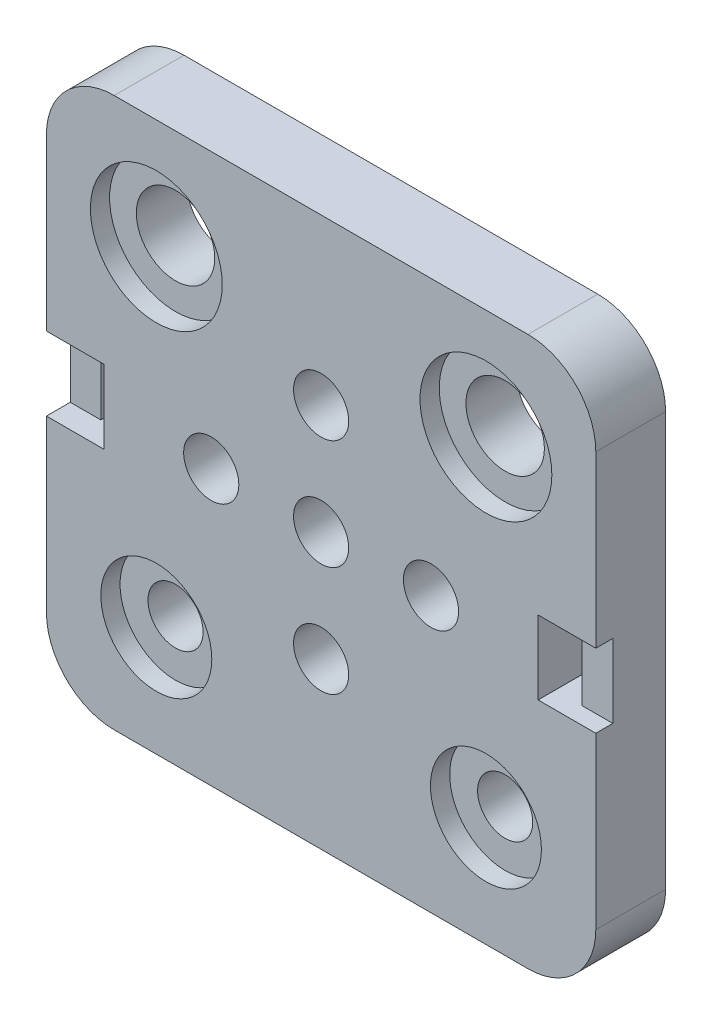
ISO-10303-21;
HEADER;
FILE_DESCRIPTION(('STEP AP214'),'2;1');
FILE_NAME('part.step','',(''),(''),'','','');
FILE_SCHEMA(('AUTOMOTIVE_DESIGN { 1 0 10303 214 1 1 1 1 }'));
ENDSEC;
DATA;
#1=APPLICATION_CONTEXT('core data for automotive mechanical design processes');
#2=APPLICATION_PROTOCOL_DEFINITION('international standard','automotive_design',2000,#1);
#3=PRODUCT_CONTEXT('',#1,'mechanical');
#4=PRODUCT('Part','Part','',(#3));
#5=PRODUCT_RELATED_PRODUCT_CATEGORY('part','',(#4));
#6=PRODUCT_DEFINITION_FORMATION('','',#4);
#7=PRODUCT_DEFINITION_CONTEXT('part definition',#1,'design');
#8=PRODUCT_DEFINITION('design','',#6,#7);
#9=PRODUCT_DEFINITION_SHAPE('','',#8);
#10=(LENGTH_UNIT() NAMED_UNIT(*) SI_UNIT(.MILLI.,.METRE.));
#11=(NAMED_UNIT(*) PLANE_ANGLE_UNIT() SI_UNIT($,.RADIAN.));
#12=(NAMED_UNIT(*) SI_UNIT($,.STERADIAN.) SOLID_ANGLE_UNIT());
#13=UNCERTAINTY_MEASURE_WITH_UNIT(LENGTH_MEASURE(1.E-05),#10,'distance_accuracy_value','');
#14=(GEOMETRIC_REPRESENTATION_CONTEXT(3) GLOBAL_UNCERTAINTY_ASSIGNED_CONTEXT((#13)) GLOBAL_UNIT_ASSIGNED_CONTEXT((#10,
#11,#12)) REPRESENTATION_CONTEXT('',''));
#15=CARTESIAN_POINT('',(0.,0.,0.));
#16=DIRECTION('',(0.,0.,1.));
#17=DIRECTION('',(1.,0.,0.));
#18=AXIS2_PLACEMENT_3D('',#15,#16,#17);
#19=CARTESIAN_POINT('',(25.,3.35,-0.65));
#20=DIRECTION('',(0.,1.,0.));
#21=DIRECTION('',(0.,0.,1.));
#22=AXIS2_PLACEMENT_3D('',#19,#20,#21);
#23=PLANE('',#22);
#24=DIRECTION('',(-1.,0.,0.));
#25=VECTOR('',#24,1.);
#26=CARTESIAN_POINT('',(25.,3.35,4.8));
#27=LINE('',#26,#25);
#28=CARTESIAN_POINT('',(25.,3.35,4.8));
#29=VERTEX_POINT('',#28);
#30=CARTESIAN_POINT('',(22.21,3.35,4.8));
#31=VERTEX_POINT('',#30);
#32=EDGE_CURVE('E766',#29,#31,#27,.T.);
#33=ORIENTED_EDGE('',*,*,#32,.F.);
#34=DIRECTION('',(0.,0.,-1.));
#35=VECTOR('',#34,1.);
#36=CARTESIAN_POINT('',(25.,3.35,6.35));
#37=LINE('',#36,#35);
#38=CARTESIAN_POINT('',(25.,3.35,6.35));
#39=VERTEX_POINT('',#38);
#40=EDGE_CURVE('E334',#39,#29,#37,.T.);
#41=ORIENTED_EDGE('',*,*,#40,.F.);
#42=DIRECTION('',(-1.,0.,0.));
#43=VECTOR('',#42,1.);
#44=CARTESIAN_POINT('',(25.,3.35,6.35));
#45=LINE('',#44,#43);
#46=CARTESIAN_POINT('',(19.75,3.35,6.35));
#47=VERTEX_POINT('',#46);
#48=EDGE_CURVE('E774',#39,#47,#45,.T.);
#49=ORIENTED_EDGE('',*,*,#48,.T.);
#50=DIRECTION('',(0.,0.,1.));
#51=VECTOR('',#50,1.);
#52=CARTESIAN_POINT('',(19.75,3.35,-0.65));
#53=LINE('',#52,#51);
#54=CARTESIAN_POINT('',(19.75,3.35,0.));
#55=VERTEX_POINT('',#54);
#56=EDGE_CURVE('E202',#55,#47,#53,.T.);
#57=ORIENTED_EDGE('',*,*,#56,.F.);
#58=DIRECTION('',(-1.,0.,0.));
#59=VECTOR('',#58,1.);
#60=CARTESIAN_POINT('',(0.,3.35,0.));
#61=LINE('',#60,#59);
#62=CARTESIAN_POINT('',(22.21,3.35,0.));
#63=VERTEX_POINT('',#62);
#64=EDGE_CURVE('E197',#63,#55,#61,.T.);
#65=ORIENTED_EDGE('',*,*,#64,.F.);
#66=DIRECTION('',(0.,0.,-1.));
#67=VECTOR('',#66,1.);
#68=CARTESIAN_POINT('',(22.21,3.35,0.));
#69=LINE('',#68,#67);
#70=EDGE_CURVE('E178',#31,#63,#69,.T.);
#71=ORIENTED_EDGE('',*,*,#70,.F.);
#72=EDGE_LOOP('',(#33,#41,#49,#57,#65,#71));
#73=FACE_BOUND('',#72,.T.);
#74=ADVANCED_FACE('F34',(#73),#23,.F.);
#75=CARTESIAN_POINT('',(25.,-3.35,-0.65));
#76=DIRECTION('',(0.,-1.,0.));
#77=DIRECTION('',(1.,0.,0.));
#78=AXIS2_PLACEMENT_3D('',#75,#76,#77);
#79=PLANE('',#78);
#80=DIRECTION('',(-1.,0.,0.));
#81=VECTOR('',#80,1.);
#82=CARTESIAN_POINT('',(25.,-3.35000000000002,4.8));
#83=LINE('',#82,#81);
#84=CARTESIAN_POINT('',(25.,-3.35000000000002,4.8));
#85=VERTEX_POINT('',#84);
#86=CARTESIAN_POINT('',(22.21,-3.35000000000002,4.8));
#87=VERTEX_POINT('',#86);
#88=EDGE_CURVE('E182',#85,#87,#83,.T.);
#89=ORIENTED_EDGE('',*,*,#88,.T.);
#90=DIRECTION('',(0.,0.,-1.));
#91=VECTOR('',#90,1.);
#92=CARTESIAN_POINT('',(22.21,-3.35000000000002,0.));
#93=LINE('',#92,#91);
#94=CARTESIAN_POINT('',(22.21,-3.35000000000002,0.));
#95=VERTEX_POINT('',#94);
#96=EDGE_CURVE('E175',#87,#95,#93,.T.);
#97=ORIENTED_EDGE('',*,*,#96,.T.);
#98=DIRECTION('',(1.,0.,0.));
#99=VECTOR('',#98,1.);
#100=CARTESIAN_POINT('',(0.,-3.35000000000001,0.));
#101=LINE('',#100,#99);
#102=CARTESIAN_POINT('',(19.75,-3.35,0.));
#103=VERTEX_POINT('',#102);
#104=EDGE_CURVE('E187',#103,#95,#101,.T.);
#105=ORIENTED_EDGE('',*,*,#104,.F.);
#106=DIRECTION('',(0.,0.,1.));
#107=VECTOR('',#106,1.);
#108=CARTESIAN_POINT('',(19.75,-3.35,-0.65));
#109=LINE('',#108,#107);
#110=CARTESIAN_POINT('',(19.75,-3.35,6.35));
#111=VERTEX_POINT('',#110);
#112=EDGE_CURVE('E198',#103,#111,#109,.T.);
#113=ORIENTED_EDGE('',*,*,#112,.T.);
#114=DIRECTION('',(1.,0.,0.));
#115=VECTOR('',#114,1.);
#116=CARTESIAN_POINT('',(25.,-3.35,6.35));
#117=LINE('',#116,#115);
#118=CARTESIAN_POINT('',(25.,-3.35,6.35));
#119=VERTEX_POINT('',#118);
#120=EDGE_CURVE('E769',#111,#119,#117,.T.);
#121=ORIENTED_EDGE('',*,*,#120,.T.);
#122=DIRECTION('',(0.,0.,1.));
#123=VECTOR('',#122,1.);
#124=CARTESIAN_POINT('',(25.,-3.35,6.35));
#125=LINE('',#124,#123);
#126=EDGE_CURVE('E331',#85,#119,#125,.T.);
#127=ORIENTED_EDGE('',*,*,#126,.F.);
#128=EDGE_LOOP('',(#89,#97,#105,#113,#121,#127));
#129=FACE_BOUND('',#128,.T.);
#130=ADVANCED_FACE('F186',(#129),#79,.F.);
#131=CARTESIAN_POINT('',(-25.,3.35,-0.65));
#132=DIRECTION('',(0.,1.,0.));
#133=DIRECTION('',(0.,0.,1.));
#134=AXIS2_PLACEMENT_3D('',#131,#132,#133);
#135=PLANE('',#134);
#136=DIRECTION('',(0.,0.,1.));
#137=VECTOR('',#136,1.);
#138=CARTESIAN_POINT('',(-22.215,3.35,0.));
#139=LINE('',#138,#137);
#140=CARTESIAN_POINT('',(-22.215,3.35,0.));
#141=VERTEX_POINT('',#140);
#142=CARTESIAN_POINT('',(-22.215,3.35,4.18));
#143=VERTEX_POINT('',#142);
#144=EDGE_CURVE('E787',#141,#143,#139,.T.);
#145=ORIENTED_EDGE('',*,*,#144,.F.);
#146=DIRECTION('',(-1.,0.,0.));
#147=VECTOR('',#146,1.);
#148=CARTESIAN_POINT('',(0.,3.35,0.));
#149=LINE('',#148,#147);
#150=CARTESIAN_POINT('',(-19.75,3.35,0.));
#151=VERTEX_POINT('',#150);
#152=EDGE_CURVE('E220',#151,#141,#149,.T.);
#153=ORIENTED_EDGE('',*,*,#152,.F.);
#154=DIRECTION('',(0.,0.,1.));
#155=VECTOR('',#154,1.);
#156=CARTESIAN_POINT('',(-19.75,3.35,-0.65));
#157=LINE('',#156,#155);
#158=CARTESIAN_POINT('',(-19.75,3.35,6.35));
#159=VERTEX_POINT('',#158);
#160=EDGE_CURVE('E215',#151,#159,#157,.T.);
#161=ORIENTED_EDGE('',*,*,#160,.T.);
#162=DIRECTION('',(-1.,0.,0.));
#163=VECTOR('',#162,1.);
#164=CARTESIAN_POINT('',(-25.,3.35,6.35));
#165=LINE('',#164,#163);
#166=CARTESIAN_POINT('',(-25.,3.35,6.35));
#167=VERTEX_POINT('',#166);
#168=EDGE_CURVE('E211',#159,#167,#165,.T.);
#169=ORIENTED_EDGE('',*,*,#168,.T.);
#170=DIRECTION('',(0.,0.,1.));
#171=VECTOR('',#170,1.);
#172=CARTESIAN_POINT('',(-25.,3.35,6.35));
#173=LINE('',#172,#171);
#174=CARTESIAN_POINT('',(-25.,3.35,4.18));
#175=VERTEX_POINT('',#174);
#176=EDGE_CURVE('E325',#175,#167,#173,.T.);
#177=ORIENTED_EDGE('',*,*,#176,.F.);
#178=DIRECTION('',(-1.,0.,0.));
#179=VECTOR('',#178,1.);
#180=CARTESIAN_POINT('',(-25.,3.35,4.18));
#181=LINE('',#180,#179);
#182=EDGE_CURVE('E786',#143,#175,#181,.T.);
#183=ORIENTED_EDGE('',*,*,#182,.F.);
#184=EDGE_LOOP('',(#145,#153,#161,#169,#177,#183));
#185=FACE_BOUND('',#184,.T.);
#186=ADVANCED_FACE('F416',(#185),#135,.F.);
#187=CARTESIAN_POINT('',(-25.,-3.35,-0.65));
#188=DIRECTION('',(0.,-1.,0.));
#189=DIRECTION('',(1.,0.,0.));
#190=AXIS2_PLACEMENT_3D('',#187,#188,#189);
#191=PLANE('',#190);
#192=DIRECTION('',(0.,0.,1.));
#193=VECTOR('',#192,1.);
#194=CARTESIAN_POINT('',(-22.215,-3.35,0.));
#195=LINE('',#194,#193);
#196=CARTESIAN_POINT('',(-22.215,-3.35,0.));
#197=VERTEX_POINT('',#196);
#198=CARTESIAN_POINT('',(-22.215,-3.35,4.18));
#199=VERTEX_POINT('',#198);
#200=EDGE_CURVE('E779',#197,#199,#195,.T.);
#201=ORIENTED_EDGE('',*,*,#200,.T.);
#202=DIRECTION('',(-1.,0.,0.));
#203=VECTOR('',#202,1.);
#204=CARTESIAN_POINT('',(-25.,-3.35,4.18));
#205=LINE('',#204,#203);
#206=CARTESIAN_POINT('',(-25.,-3.35,4.18));
#207=VERTEX_POINT('',#206);
#208=EDGE_CURVE('E790',#199,#207,#205,.T.);
#209=ORIENTED_EDGE('',*,*,#208,.T.);
#210=DIRECTION('',(0.,0.,-1.));
#211=VECTOR('',#210,1.);
#212=CARTESIAN_POINT('',(-25.,-3.35,6.35));
#213=LINE('',#212,#211);
#214=CARTESIAN_POINT('',(-25.,-3.35,6.35));
#215=VERTEX_POINT('',#214);
#216=EDGE_CURVE('E304',#215,#207,#213,.T.);
#217=ORIENTED_EDGE('',*,*,#216,.F.);
#218=DIRECTION('',(1.,0.,0.));
#219=VECTOR('',#218,1.);
#220=CARTESIAN_POINT('',(-25.,-3.35,6.35));
#221=LINE('',#220,#219);
#222=CARTESIAN_POINT('',(-19.75,-3.35,6.35));
#223=VERTEX_POINT('',#222);
#224=EDGE_CURVE('E200',#215,#223,#221,.T.);
#225=ORIENTED_EDGE('',*,*,#224,.T.);
#226=DIRECTION('',(0.,0.,1.));
#227=VECTOR('',#226,1.);
#228=CARTESIAN_POINT('',(-19.75,-3.35,-0.65));
#229=LINE('',#228,#227);
#230=CARTESIAN_POINT('',(-19.75,-3.35,0.));
#231=VERTEX_POINT('',#230);
#232=EDGE_CURVE('E214',#231,#223,#229,.T.);
#233=ORIENTED_EDGE('',*,*,#232,.F.);
#234=DIRECTION('',(1.,0.,0.));
#235=VECTOR('',#234,1.);
#236=CARTESIAN_POINT('',(0.,-3.35000000000001,0.));
#237=LINE('',#236,#235);
#238=EDGE_CURVE('E217',#197,#231,#237,.T.);
#239=ORIENTED_EDGE('',*,*,#238,.F.);
#240=EDGE_LOOP('',(#201,#209,#217,#225,#233,#239));
#241=FACE_BOUND('',#240,.T.);
#242=ADVANCED_FACE('F424',(#241),#191,.F.);
#243=CARTESIAN_POINT('',(15.,-15.,6.35));
#244=DIRECTION('',(0.,0.,-1.));
#245=DIRECTION('',(-1.,0.,0.));
#246=AXIS2_PLACEMENT_3D('',#243,#244,#245);
#247=CYLINDRICAL_SURFACE('',#246,2.51);
#248=CARTESIAN_POINT('',(15.,-15.,0.));
#249=DIRECTION('',(0.,0.,1.));
#250=DIRECTION('',(1.,0.,0.));
#251=AXIS2_PLACEMENT_3D('',#248,#249,#250);
#252=CIRCLE('',#251,2.51);
#253=CARTESIAN_POINT('',(17.51,-15.,0.));
#254=VERTEX_POINT('',#253);
#255=EDGE_CURVE('E284',#254,#254,#252,.T.);
#256=ORIENTED_EDGE('',*,*,#255,.F.);
#257=EDGE_LOOP('',(#256));
#258=FACE_BOUND('',#257,.T.);
#259=CARTESIAN_POINT('',(15.,-15.,4.6));
#260=DIRECTION('',(0.,0.,1.));
#261=DIRECTION('',(1.,0.,0.));
#262=AXIS2_PLACEMENT_3D('',#259,#260,#261);
#263=CIRCLE('',#262,2.51);
#264=CARTESIAN_POINT('',(17.51,-15.,4.6));
#265=VERTEX_POINT('',#264);
#266=EDGE_CURVE('E227',#265,#265,#263,.T.);
#267=ORIENTED_EDGE('',*,*,#266,.T.);
#268=EDGE_LOOP('',(#267));
#269=FACE_BOUND('',#268,.T.);
#270=ADVANCED_FACE('F433',(#258,#269),#247,.F.);
#271=CARTESIAN_POINT('',(-15.,-15.,6.35));
#272=DIRECTION('',(0.,0.,-1.));
#273=DIRECTION('',(-1.,0.,0.));
#274=AXIS2_PLACEMENT_3D('',#271,#272,#273);
#275=CYLINDRICAL_SURFACE('',#274,2.51);
#276=CARTESIAN_POINT('',(-15.,-15.,0.));
#277=DIRECTION('',(0.,0.,1.));
#278=DIRECTION('',(1.,0.,0.));
#279=AXIS2_PLACEMENT_3D('',#276,#277,#278);
#280=CIRCLE('',#279,2.51);
#281=CARTESIAN_POINT('',(-12.49,-15.,0.));
#282=VERTEX_POINT('',#281);
#283=EDGE_CURVE('E279',#282,#282,#280,.T.);
#284=ORIENTED_EDGE('',*,*,#283,.F.);
#285=EDGE_LOOP('',(#284));
#286=FACE_BOUND('',#285,.T.);
#287=CARTESIAN_POINT('',(-15.,-15.,4.6));
#288=DIRECTION('',(0.,0.,1.));
#289=DIRECTION('',(1.,0.,0.));
#290=AXIS2_PLACEMENT_3D('',#287,#288,#289);
#291=CIRCLE('',#290,2.51);
#292=CARTESIAN_POINT('',(-12.49,-15.,4.6));
#293=VERTEX_POINT('',#292);
#294=EDGE_CURVE('E233',#293,#293,#291,.T.);
#295=ORIENTED_EDGE('',*,*,#294,.T.);
#296=EDGE_LOOP('',(#295));
#297=FACE_BOUND('',#296,.T.);
#298=ADVANCED_FACE('F486',(#286,#297),#275,.F.);
#299=CARTESIAN_POINT('',(-15.,15.,6.35));
#300=DIRECTION('',(0.,0.,-1.));
#301=DIRECTION('',(-1.,0.,0.));
#302=AXIS2_PLACEMENT_3D('',#299,#300,#301);
#303=CYLINDRICAL_SURFACE('',#302,3.57);
#304=CARTESIAN_POINT('',(-15.,15.,0.));
#305=DIRECTION('',(0.,0.,1.));
#306=DIRECTION('',(1.,0.,0.));
#307=AXIS2_PLACEMENT_3D('',#304,#305,#306);
#308=CIRCLE('',#307,3.57);
#309=CARTESIAN_POINT('',(-11.43,15.,0.));
#310=VERTEX_POINT('',#309);
#311=EDGE_CURVE('E290',#310,#310,#308,.T.);
#312=ORIENTED_EDGE('',*,*,#311,.F.);
#313=EDGE_LOOP('',(#312));
#314=FACE_BOUND('',#313,.T.);
#315=CARTESIAN_POINT('',(-15.,15.,4.6));
#316=DIRECTION('',(0.,0.,1.));
#317=DIRECTION('',(1.,0.,0.));
#318=AXIS2_PLACEMENT_3D('',#315,#316,#317);
#319=CIRCLE('',#318,3.57);
#320=CARTESIAN_POINT('',(-11.43,15.,4.6));
#321=VERTEX_POINT('',#320);
#322=EDGE_CURVE('E240',#321,#321,#319,.T.);
#323=ORIENTED_EDGE('',*,*,#322,.T.);
#324=EDGE_LOOP('',(#323));
#325=FACE_BOUND('',#324,.T.);
#326=ADVANCED_FACE('F489',(#314,#325),#303,.F.);
#327=CARTESIAN_POINT('',(15.,15.,6.35));
#328=DIRECTION('',(0.,0.,-1.));
#329=DIRECTION('',(-1.,0.,0.));
#330=AXIS2_PLACEMENT_3D('',#327,#328,#329);
#331=CYLINDRICAL_SURFACE('',#330,3.57);
#332=CARTESIAN_POINT('',(15.,15.,0.));
#333=DIRECTION('',(0.,0.,1.));
#334=DIRECTION('',(1.,0.,0.));
#335=AXIS2_PLACEMENT_3D('',#332,#333,#334);
#336=CIRCLE('',#335,3.57);
#337=CARTESIAN_POINT('',(18.57,15.,0.));
#338=VERTEX_POINT('',#337);
#339=EDGE_CURVE('E287',#338,#338,#336,.T.);
#340=ORIENTED_EDGE('',*,*,#339,.F.);
#341=EDGE_LOOP('',(#340));
#342=FACE_BOUND('',#341,.T.);
#343=CARTESIAN_POINT('',(15.,15.,4.6));
#344=DIRECTION('',(0.,0.,1.));
#345=DIRECTION('',(1.,0.,0.));
#346=AXIS2_PLACEMENT_3D('',#343,#344,#345);
#347=CIRCLE('',#346,3.57);
#348=CARTESIAN_POINT('',(18.57,15.,4.6));
#349=VERTEX_POINT('',#348);
#350=EDGE_CURVE('E247',#349,#349,#347,.T.);
#351=ORIENTED_EDGE('',*,*,#350,.T.);
#352=EDGE_LOOP('',(#351));
#353=FACE_BOUND('',#352,.T.);
#354=ADVANCED_FACE('F494',(#342,#353),#331,.F.);
#355=CARTESIAN_POINT('',(0.,0.,6.35));
#356=DIRECTION('',(0.,0.,1.));
#357=DIRECTION('',(1.,0.,0.));
#358=AXIS2_PLACEMENT_3D('',#355,#356,#357);
#359=PLANE('',#358);
#360=DIRECTION('',(0.,-1.,0.));
#361=VECTOR('',#360,1.);
#362=CARTESIAN_POINT('',(-25.,25.,6.35));
#363=LINE('',#362,#361);
#364=CARTESIAN_POINT('',(-25.,-18.83,6.35));
#365=VERTEX_POINT('',#364);
#366=EDGE_CURVE('E299',#215,#365,#363,.T.);
#367=ORIENTED_EDGE('',*,*,#366,.T.);
#368=CARTESIAN_POINT('',(-18.83,-18.83,6.35));
#369=DIRECTION('',(0.,0.,1.));
#370=DIRECTION('',(1.,0.,0.));
#371=AXIS2_PLACEMENT_3D('',#368,#369,#370);
#372=CIRCLE('',#371,6.17);
#373=CARTESIAN_POINT('',(-18.83,-25.,6.35));
#374=VERTEX_POINT('',#373);
#375=EDGE_CURVE('E361',#365,#374,#372,.T.);
#376=ORIENTED_EDGE('',*,*,#375,.T.);
#377=DIRECTION('',(1.,0.,0.));
#378=VECTOR('',#377,1.);
#379=CARTESIAN_POINT('',(-25.,-25.,6.35));
#380=LINE('',#379,#378);
#381=CARTESIAN_POINT('',(18.83,-25.,6.35));
#382=VERTEX_POINT('',#381);
#383=EDGE_CURVE('E302',#374,#382,#380,.T.);
#384=ORIENTED_EDGE('',*,*,#383,.T.);
#385=CARTESIAN_POINT('',(18.83,-18.83,6.35));
#386=DIRECTION('',(0.,0.,1.));
#387=DIRECTION('',(1.,0.,0.));
#388=AXIS2_PLACEMENT_3D('',#385,#386,#387);
#389=CIRCLE('',#388,6.17);
#390=CARTESIAN_POINT('',(25.,-18.83,6.35));
#391=VERTEX_POINT('',#390);
#392=EDGE_CURVE('E49',#382,#391,#389,.T.);
#393=ORIENTED_EDGE('',*,*,#392,.T.);
#394=DIRECTION('',(0.,1.,0.));
#395=VECTOR('',#394,1.);
#396=CARTESIAN_POINT('',(25.,25.,6.35));
#397=LINE('',#396,#395);
#398=EDGE_CURVE('E294',#391,#119,#397,.T.);
#399=ORIENTED_EDGE('',*,*,#398,.T.);
#400=ORIENTED_EDGE('',*,*,#120,.F.);
#401=DIRECTION('',(0.,-1.,0.));
#402=VECTOR('',#401,1.);
#403=CARTESIAN_POINT('',(19.75,3.35,6.35));
#404=LINE('',#403,#402);
#405=EDGE_CURVE('E772',#47,#111,#404,.T.);
#406=ORIENTED_EDGE('',*,*,#405,.F.);
#407=ORIENTED_EDGE('',*,*,#48,.F.);
#408=CARTESIAN_POINT('',(25.,18.83,6.35));
#409=VERTEX_POINT('',#408);
#410=EDGE_CURVE('E297',#39,#409,#397,.T.);
#411=ORIENTED_EDGE('',*,*,#410,.T.);
#412=CARTESIAN_POINT('',(18.83,18.83,6.35));
#413=DIRECTION('',(0.,0.,1.));
#414=DIRECTION('',(1.,0.,0.));
#415=AXIS2_PLACEMENT_3D('',#412,#413,#414);
#416=CIRCLE('',#415,6.17);
#417=CARTESIAN_POINT('',(18.83,25.,6.35));
#418=VERTEX_POINT('',#417);
#419=EDGE_CURVE('E358',#409,#418,#416,.T.);
#420=ORIENTED_EDGE('',*,*,#419,.T.);
#421=DIRECTION('',(-1.,0.,0.));
#422=VECTOR('',#421,1.);
#423=CARTESIAN_POINT('',(-25.,25.,6.35));
#424=LINE('',#423,#422);
#425=CARTESIAN_POINT('',(-18.83,25.,6.35));
#426=VERTEX_POINT('',#425);
#427=EDGE_CURVE('E296',#418,#426,#424,.T.);
#428=ORIENTED_EDGE('',*,*,#427,.T.);
#429=CARTESIAN_POINT('',(-18.83,18.83,6.35));
#430=DIRECTION('',(0.,0.,1.));
#431=DIRECTION('',(1.,0.,0.));
#432=AXIS2_PLACEMENT_3D('',#429,#430,#431);
#433=CIRCLE('',#432,6.17);
#434=CARTESIAN_POINT('',(-25.,18.83,6.35));
#435=VERTEX_POINT('',#434);
#436=EDGE_CURVE('E356',#426,#435,#433,.T.);
#437=ORIENTED_EDGE('',*,*,#436,.T.);
#438=EDGE_CURVE('E300',#435,#167,#363,.T.);
#439=ORIENTED_EDGE('',*,*,#438,.T.);
#440=ORIENTED_EDGE('',*,*,#168,.F.);
#441=DIRECTION('',(0.,1.,0.));
#442=VECTOR('',#441,1.);
#443=CARTESIAN_POINT('',(-19.75,3.35,6.35));
#444=LINE('',#443,#442);
#445=EDGE_CURVE('E208',#223,#159,#444,.T.);
#446=ORIENTED_EDGE('',*,*,#445,.F.);
#447=ORIENTED_EDGE('',*,*,#224,.F.);
#448=EDGE_LOOP('',(#367,#376,#384,#393,#399,#400,#406,#407,#411,#420,#428,#437,#439,#440,#446,#447));
#449=FACE_BOUND('',#448,.T.);
#450=CARTESIAN_POINT('',(15.,-15.,6.35));
#451=DIRECTION('',(0.,0.,1.));
#452=DIRECTION('',(1.,0.,0.));
#453=AXIS2_PLACEMENT_3D('',#450,#451,#452);
#454=CIRCLE('',#453,5.05);
#455=CARTESIAN_POINT('',(20.05,-15.,6.35));
#456=VERTEX_POINT('',#455);
#457=EDGE_CURVE('E223',#456,#456,#454,.T.);
#458=ORIENTED_EDGE('',*,*,#457,.F.);
#459=EDGE_LOOP('',(#458));
#460=FACE_BOUND('',#459,.T.);
#461=CARTESIAN_POINT('',(-15.,-15.,6.35));
#462=DIRECTION('',(0.,0.,1.));
#463=DIRECTION('',(1.,0.,0.));
#464=AXIS2_PLACEMENT_3D('',#461,#462,#463);
#465=CIRCLE('',#464,5.05);
#466=CARTESIAN_POINT('',(-9.95000000000001,-15.,6.35));
#467=VERTEX_POINT('',#466);
#468=EDGE_CURVE('E234',#467,#467,#465,.T.);
#469=ORIENTED_EDGE('',*,*,#468,.F.);
#470=EDGE_LOOP('',(#469));
#471=FACE_BOUND('',#470,.T.);
#472=CARTESIAN_POINT('',(-15.,15.,6.35));
#473=DIRECTION('',(0.,0.,1.));
#474=DIRECTION('',(1.,0.,0.));
#475=AXIS2_PLACEMENT_3D('',#472,#473,#474);
#476=CIRCLE('',#475,6.);
#477=CARTESIAN_POINT('',(-9.00000000000001,15.,6.35));
#478=VERTEX_POINT('',#477);
#479=EDGE_CURVE('E241',#478,#478,#476,.T.);
#480=ORIENTED_EDGE('',*,*,#479,.F.);
#481=EDGE_LOOP('',(#480));
#482=FACE_BOUND('',#481,.T.);
#483=CARTESIAN_POINT('',(15.,15.,6.35));
#484=DIRECTION('',(0.,0.,1.));
#485=DIRECTION('',(1.,0.,0.));
#486=AXIS2_PLACEMENT_3D('',#483,#484,#485);
#487=CIRCLE('',#486,6.);
#488=CARTESIAN_POINT('',(21.,15.,6.35));
#489=VERTEX_POINT('',#488);
#490=EDGE_CURVE('E248',#489,#489,#487,.T.);
#491=ORIENTED_EDGE('',*,*,#490,.F.);
#492=EDGE_LOOP('',(#491));
#493=FACE_BOUND('',#492,.T.);
#494=CARTESIAN_POINT('',(0.,-10.,6.35));
#495=DIRECTION('',(0.,0.,1.));
#496=DIRECTION('',(1.,0.,0.));
#497=AXIS2_PLACEMENT_3D('',#494,#495,#496);
#498=CIRCLE('',#497,2.51);
#499=CARTESIAN_POINT('',(2.51,-10.,6.35));
#500=VERTEX_POINT('',#499);
#501=EDGE_CURVE('E258',#500,#500,#498,.T.);
#502=ORIENTED_EDGE('',*,*,#501,.F.);
#503=EDGE_LOOP('',(#502));
#504=FACE_BOUND('',#503,.T.);
#505=CARTESIAN_POINT('',(0.,10.,6.35));
#506=DIRECTION('',(0.,0.,1.));
#507=DIRECTION('',(1.,0.,0.));
#508=AXIS2_PLACEMENT_3D('',#505,#506,#507);
#509=CIRCLE('',#508,2.51);
#510=CARTESIAN_POINT('',(2.51,10.,6.35));
#511=VERTEX_POINT('',#510);
#512=EDGE_CURVE('E270',#511,#511,#509,.T.);
#513=ORIENTED_EDGE('',*,*,#512,.F.);
#514=EDGE_LOOP('',(#513));
#515=FACE_BOUND('',#514,.T.);
#516=CARTESIAN_POINT('',(-10.,0.,6.35));
#517=DIRECTION('',(0.,0.,1.));
#518=DIRECTION('',(1.,0.,0.));
#519=AXIS2_PLACEMENT_3D('',#516,#517,#518);
#520=CIRCLE('',#519,2.51);
#521=CARTESIAN_POINT('',(-7.49,0.,6.35));
#522=VERTEX_POINT('',#521);
#523=EDGE_CURVE('E276',#522,#522,#520,.T.);
#524=ORIENTED_EDGE('',*,*,#523,.F.);
#525=EDGE_LOOP('',(#524));
#526=FACE_BOUND('',#525,.T.);
#527=CARTESIAN_POINT('',(10.,0.,6.35));
#528=DIRECTION('',(0.,0.,1.));
#529=DIRECTION('',(1.,0.,0.));
#530=AXIS2_PLACEMENT_3D('',#527,#528,#529);
#531=CIRCLE('',#530,2.51);
#532=CARTESIAN_POINT('',(12.51,0.,6.35));
#533=VERTEX_POINT('',#532);
#534=EDGE_CURVE('E264',#533,#533,#531,.T.);
#535=ORIENTED_EDGE('',*,*,#534,.F.);
#536=EDGE_LOOP('',(#535));
#537=FACE_BOUND('',#536,.T.);
#538=CARTESIAN_POINT('',(0.,0.,6.35));
#539=DIRECTION('',(0.,0.,1.));
#540=DIRECTION('',(1.,0.,0.));
#541=AXIS2_PLACEMENT_3D('',#538,#539,#540);
#542=CIRCLE('',#541,2.51);
#543=CARTESIAN_POINT('',(2.51,0.,6.35));
#544=VERTEX_POINT('',#543);
#545=EDGE_CURVE('E251',#544,#544,#542,.T.);
#546=ORIENTED_EDGE('',*,*,#545,.F.);
#547=EDGE_LOOP('',(#546));
#548=FACE_BOUND('',#547,.T.);
#549=ADVANCED_FACE('F384',(#449,#460,#471,#482,#493,#504,#515,#526,#537,#548),#359,.T.);
#550=CARTESIAN_POINT('',(0.,0.,0.));
#551=DIRECTION('',(0.,0.,1.));
#552=DIRECTION('',(1.,0.,0.));
#553=AXIS2_PLACEMENT_3D('',#550,#551,#552);
#554=PLANE('',#553);
#555=DIRECTION('',(0.,1.,0.));
#556=VECTOR('',#555,1.);
#557=CARTESIAN_POINT('',(22.21,-8.90194560492087,0.));
#558=LINE('',#557,#556);
#559=EDGE_CURVE('E172',#95,#63,#558,.T.);
#560=ORIENTED_EDGE('',*,*,#559,.T.);
#561=ORIENTED_EDGE('',*,*,#64,.T.);
#562=DIRECTION('',(0.,-1.,0.));
#563=VECTOR('',#562,1.);
#564=CARTESIAN_POINT('',(19.75,0.,0.));
#565=LINE('',#564,#563);
#566=EDGE_CURVE('E196',#55,#103,#565,.T.);
#567=ORIENTED_EDGE('',*,*,#566,.T.);
#568=ORIENTED_EDGE('',*,*,#104,.T.);
#569=EDGE_LOOP('',(#560,#561,#567,#568));
#570=FACE_BOUND('',#569,.T.);
#571=ORIENTED_EDGE('',*,*,#152,.T.);
#572=DIRECTION('',(0.,1.,0.));
#573=VECTOR('',#572,1.);
#574=CARTESIAN_POINT('',(-22.215,-8.90194560492087,0.));
#575=LINE('',#574,#573);
#576=EDGE_CURVE('E782',#197,#141,#575,.T.);
#577=ORIENTED_EDGE('',*,*,#576,.F.);
#578=ORIENTED_EDGE('',*,*,#238,.T.);
#579=DIRECTION('',(0.,1.,0.));
#580=VECTOR('',#579,1.);
#581=CARTESIAN_POINT('',(-19.75,0.,0.));
#582=LINE('',#581,#580);
#583=EDGE_CURVE('E328',#231,#151,#582,.T.);
#584=ORIENTED_EDGE('',*,*,#583,.T.);
#585=EDGE_LOOP('',(#571,#577,#578,#584));
#586=FACE_BOUND('',#585,.T.);
#587=DIRECTION('',(1.,0.,0.));
#588=VECTOR('',#587,1.);
#589=CARTESIAN_POINT('',(-25.,-25.,0.));
#590=LINE('',#589,#588);
#591=CARTESIAN_POINT('',(-18.83,-25.,0.));
#592=VERTEX_POINT('',#591);
#593=CARTESIAN_POINT('',(18.83,-25.,0.));
#594=VERTEX_POINT('',#593);
#595=EDGE_CURVE('E312',#592,#594,#590,.T.);
#596=ORIENTED_EDGE('',*,*,#595,.F.);
#597=CARTESIAN_POINT('',(-18.83,-18.83,0.));
#598=DIRECTION('',(0.,0.,1.));
#599=DIRECTION('',(1.,0.,0.));
#600=AXIS2_PLACEMENT_3D('',#597,#598,#599);
#601=CIRCLE('',#600,6.17);
#602=CARTESIAN_POINT('',(-25.,-18.83,0.));
#603=VERTEX_POINT('',#602);
#604=EDGE_CURVE('E349',#592,#603,#601,.F.);
#605=ORIENTED_EDGE('',*,*,#604,.T.);
#606=DIRECTION('',(0.,-1.,0.));
#607=VECTOR('',#606,1.);
#608=CARTESIAN_POINT('',(-25.,25.,0.));
#609=LINE('',#608,#607);
#610=CARTESIAN_POINT('',(-25.,18.83,0.));
#611=VERTEX_POINT('',#610);
#612=EDGE_CURVE('E309',#611,#603,#609,.T.);
#613=ORIENTED_EDGE('',*,*,#612,.F.);
#614=CARTESIAN_POINT('',(-18.83,18.83,0.));
#615=DIRECTION('',(0.,0.,1.));
#616=DIRECTION('',(1.,0.,0.));
#617=AXIS2_PLACEMENT_3D('',#614,#615,#616);
#618=CIRCLE('',#617,6.17);
#619=CARTESIAN_POINT('',(-18.83,25.,0.));
#620=VERTEX_POINT('',#619);
#621=EDGE_CURVE('E343',#611,#620,#618,.F.);
#622=ORIENTED_EDGE('',*,*,#621,.T.);
#623=DIRECTION('',(-1.,0.,0.));
#624=VECTOR('',#623,1.);
#625=CARTESIAN_POINT('',(-25.,25.,0.));
#626=LINE('',#625,#624);
#627=CARTESIAN_POINT('',(18.83,25.,0.));
#628=VERTEX_POINT('',#627);
#629=EDGE_CURVE('E307',#628,#620,#626,.T.);
#630=ORIENTED_EDGE('',*,*,#629,.F.);
#631=CARTESIAN_POINT('',(18.83,18.83,0.));
#632=DIRECTION('',(0.,0.,1.));
#633=DIRECTION('',(1.,0.,0.));
#634=AXIS2_PLACEMENT_3D('',#631,#632,#633);
#635=CIRCLE('',#634,6.17);
#636=CARTESIAN_POINT('',(25.,18.83,0.));
#637=VERTEX_POINT('',#636);
#638=EDGE_CURVE('E345',#628,#637,#635,.F.);
#639=ORIENTED_EDGE('',*,*,#638,.T.);
#640=DIRECTION('',(0.,1.,0.));
#641=VECTOR('',#640,1.);
#642=CARTESIAN_POINT('',(25.,25.,0.));
#643=LINE('',#642,#641);
#644=CARTESIAN_POINT('',(25.,-18.83,0.));
#645=VERTEX_POINT('',#644);
#646=EDGE_CURVE('E293',#645,#637,#643,.T.);
#647=ORIENTED_EDGE('',*,*,#646,.F.);
#648=CARTESIAN_POINT('',(18.83,-18.83,0.));
#649=DIRECTION('',(0.,0.,1.));
#650=DIRECTION('',(1.,0.,0.));
#651=AXIS2_PLACEMENT_3D('',#648,#649,#650);
#652=CIRCLE('',#651,6.17);
#653=EDGE_CURVE('E347',#645,#594,#652,.F.);
#654=ORIENTED_EDGE('',*,*,#653,.T.);
#655=EDGE_LOOP('',(#596,#605,#613,#622,#630,#639,#647,#654));
#656=FACE_BOUND('',#655,.T.);
#657=CARTESIAN_POINT('',(0.,-10.,0.));
#658=DIRECTION('',(0.,0.,1.));
#659=DIRECTION('',(1.,0.,0.));
#660=AXIS2_PLACEMENT_3D('',#657,#658,#659);
#661=CIRCLE('',#660,2.51);
#662=CARTESIAN_POINT('',(2.51,-10.,0.));
#663=VERTEX_POINT('',#662);
#664=EDGE_CURVE('E254',#663,#663,#661,.T.);
#665=ORIENTED_EDGE('',*,*,#664,.T.);
#666=EDGE_LOOP('',(#665));
#667=FACE_BOUND('',#666,.T.);
#668=CARTESIAN_POINT('',(0.,10.,0.));
#669=DIRECTION('',(0.,0.,1.));
#670=DIRECTION('',(1.,0.,0.));
#671=AXIS2_PLACEMENT_3D('',#668,#669,#670);
#672=CIRCLE('',#671,2.51);
#673=CARTESIAN_POINT('',(2.51,10.,0.));
#674=VERTEX_POINT('',#673);
#675=EDGE_CURVE('E267',#674,#674,#672,.T.);
#676=ORIENTED_EDGE('',*,*,#675,.T.);
#677=EDGE_LOOP('',(#676));
#678=FACE_BOUND('',#677,.T.);
#679=ORIENTED_EDGE('',*,*,#283,.T.);
#680=EDGE_LOOP('',(#679));
#681=FACE_BOUND('',#680,.T.);
#682=ORIENTED_EDGE('',*,*,#339,.T.);
#683=EDGE_LOOP('',(#682));
#684=FACE_BOUND('',#683,.T.);
#685=ORIENTED_EDGE('',*,*,#311,.T.);
#686=EDGE_LOOP('',(#685));
#687=FACE_BOUND('',#686,.T.);
#688=ORIENTED_EDGE('',*,*,#255,.T.);
#689=EDGE_LOOP('',(#688));
#690=FACE_BOUND('',#689,.T.);
#691=CARTESIAN_POINT('',(-10.,0.,0.));
#692=DIRECTION('',(0.,0.,1.));
#693=DIRECTION('',(1.,0.,0.));
#694=AXIS2_PLACEMENT_3D('',#691,#692,#693);
#695=CIRCLE('',#694,2.51);
#696=CARTESIAN_POINT('',(-7.49,0.,0.));
#697=VERTEX_POINT('',#696);
#698=EDGE_CURVE('E273',#697,#697,#695,.T.);
#699=ORIENTED_EDGE('',*,*,#698,.T.);
#700=EDGE_LOOP('',(#699));
#701=FACE_BOUND('',#700,.T.);
#702=CARTESIAN_POINT('',(10.,0.,0.));
#703=DIRECTION('',(0.,0.,1.));
#704=DIRECTION('',(1.,0.,0.));
#705=AXIS2_PLACEMENT_3D('',#702,#703,#704);
#706=CIRCLE('',#705,2.51);
#707=CARTESIAN_POINT('',(12.51,0.,0.));
#708=VERTEX_POINT('',#707);
#709=EDGE_CURVE('E261',#708,#708,#706,.T.);
#710=ORIENTED_EDGE('',*,*,#709,.T.);
#711=EDGE_LOOP('',(#710));
#712=FACE_BOUND('',#711,.T.);
#713=CARTESIAN_POINT('',(0.,0.,0.));
#714=DIRECTION('',(0.,0.,1.));
#715=DIRECTION('',(1.,0.,0.));
#716=AXIS2_PLACEMENT_3D('',#713,#714,#715);
#717=CIRCLE('',#716,2.51);
#718=CARTESIAN_POINT('',(2.51,0.,0.));
#719=VERTEX_POINT('',#718);
#720=EDGE_CURVE('E255',#719,#719,#717,.T.);
#721=ORIENTED_EDGE('',*,*,#720,.T.);
#722=EDGE_LOOP('',(#721));
#723=FACE_BOUND('',#722,.T.);
#724=ADVANCED_FACE('F193',(#570,#586,#656,#667,#678,#681,#684,#687,#690,#701,#712,#723),#554,.F.);
#725=CARTESIAN_POINT('',(25.,25.,6.35));
#726=DIRECTION('',(-1.,0.,0.));
#727=DIRECTION('',(0.,-1.,0.));
#728=AXIS2_PLACEMENT_3D('',#725,#726,#727);
#729=PLANE('',#728);
#730=ORIENTED_EDGE('',*,*,#398,.F.);
#731=DIRECTION('',(0.,0.,-1.));
#732=VECTOR('',#731,1.);
#733=CARTESIAN_POINT('',(25.,-18.83,6.35));
#734=LINE('',#733,#732);
#735=EDGE_CURVE('E365',#391,#645,#734,.T.);
#736=ORIENTED_EDGE('',*,*,#735,.T.);
#737=ORIENTED_EDGE('',*,*,#646,.T.);
#738=DIRECTION('',(0.,0.,-1.));
#739=VECTOR('',#738,1.);
#740=CARTESIAN_POINT('',(25.,18.83,6.35));
#741=LINE('',#740,#739);
#742=EDGE_CURVE('E363',#637,#409,#741,.F.);
#743=ORIENTED_EDGE('',*,*,#742,.T.);
#744=ORIENTED_EDGE('',*,*,#410,.F.);
#745=ORIENTED_EDGE('',*,*,#40,.T.);
#746=DIRECTION('',(0.,1.,0.));
#747=VECTOR('',#746,1.);
#748=CARTESIAN_POINT('',(25.,-8.90194560492087,4.8));
#749=LINE('',#748,#747);
#750=EDGE_CURVE('E761',#85,#29,#749,.T.);
#751=ORIENTED_EDGE('',*,*,#750,.F.);
#752=ORIENTED_EDGE('',*,*,#126,.T.);
#753=EDGE_LOOP('',(#730,#736,#737,#743,#744,#745,#751,#752));
#754=FACE_BOUND('',#753,.T.);
#755=ADVANCED_FACE('F370',(#754),#729,.F.);
#756=CARTESIAN_POINT('',(-25.,25.,6.35));
#757=DIRECTION('',(0.,-1.,0.));
#758=DIRECTION('',(0.,0.,-1.));
#759=AXIS2_PLACEMENT_3D('',#756,#757,#758);
#760=PLANE('',#759);
#761=ORIENTED_EDGE('',*,*,#427,.F.);
#762=DIRECTION('',(0.,0.,-1.));
#763=VECTOR('',#762,1.);
#764=CARTESIAN_POINT('',(18.83,25.,6.35));
#765=LINE('',#764,#763);
#766=EDGE_CURVE('E11',#418,#628,#765,.T.);
#767=ORIENTED_EDGE('',*,*,#766,.T.);
#768=ORIENTED_EDGE('',*,*,#629,.T.);
#769=DIRECTION('',(0.,0.,-1.));
#770=VECTOR('',#769,1.);
#771=CARTESIAN_POINT('',(-18.83,25.,6.35));
#772=LINE('',#771,#770);
#773=EDGE_CURVE('E42',#620,#426,#772,.F.);
#774=ORIENTED_EDGE('',*,*,#773,.T.);
#775=EDGE_LOOP('',(#761,#767,#768,#774));
#776=FACE_BOUND('',#775,.T.);
#777=ADVANCED_FACE('F381',(#776),#760,.F.);
#778=CARTESIAN_POINT('',(-25.,25.,6.35));
#779=DIRECTION('',(1.,0.,0.));
#780=DIRECTION('',(0.,1.,0.));
#781=AXIS2_PLACEMENT_3D('',#778,#779,#780);
#782=PLANE('',#781);
#783=ORIENTED_EDGE('',*,*,#612,.T.);
#784=DIRECTION('',(0.,0.,-1.));
#785=VECTOR('',#784,1.);
#786=CARTESIAN_POINT('',(-25.,-18.83,6.35));
#787=LINE('',#786,#785);
#788=EDGE_CURVE('E354',#603,#365,#787,.F.);
#789=ORIENTED_EDGE('',*,*,#788,.T.);
#790=ORIENTED_EDGE('',*,*,#366,.F.);
#791=ORIENTED_EDGE('',*,*,#216,.T.);
#792=DIRECTION('',(0.,1.,0.));
#793=VECTOR('',#792,1.);
#794=CARTESIAN_POINT('',(-25.,-8.90194560492087,4.18));
#795=LINE('',#794,#793);
#796=EDGE_CURVE('E190',#207,#175,#795,.T.);
#797=ORIENTED_EDGE('',*,*,#796,.T.);
#798=ORIENTED_EDGE('',*,*,#176,.T.);
#799=ORIENTED_EDGE('',*,*,#438,.F.);
#800=DIRECTION('',(0.,0.,-1.));
#801=VECTOR('',#800,1.);
#802=CARTESIAN_POINT('',(-25.,18.83,6.35));
#803=LINE('',#802,#801);
#804=EDGE_CURVE('E351',#435,#611,#803,.T.);
#805=ORIENTED_EDGE('',*,*,#804,.T.);
#806=EDGE_LOOP('',(#783,#789,#790,#791,#797,#798,#799,#805));
#807=FACE_BOUND('',#806,.T.);
#808=ADVANCED_FACE('F392',(#807),#782,.F.);
#809=CARTESIAN_POINT('',(-25.,-25.,6.35));
#810=DIRECTION('',(0.,1.,0.));
#811=DIRECTION('',(0.,0.,1.));
#812=AXIS2_PLACEMENT_3D('',#809,#810,#811);
#813=PLANE('',#812);
#814=ORIENTED_EDGE('',*,*,#383,.F.);
#815=DIRECTION('',(0.,0.,-1.));
#816=VECTOR('',#815,1.);
#817=CARTESIAN_POINT('',(-18.83,-25.,6.35));
#818=LINE('',#817,#816);
#819=EDGE_CURVE('E340',#374,#592,#818,.T.);
#820=ORIENTED_EDGE('',*,*,#819,.T.);
#821=ORIENTED_EDGE('',*,*,#595,.T.);
#822=DIRECTION('',(0.,0.,-1.));
#823=VECTOR('',#822,1.);
#824=CARTESIAN_POINT('',(18.83,-25.,6.35));
#825=LINE('',#824,#823);
#826=EDGE_CURVE('E338',#594,#382,#825,.F.);
#827=ORIENTED_EDGE('',*,*,#826,.T.);
#828=EDGE_LOOP('',(#814,#820,#821,#827));
#829=FACE_BOUND('',#828,.T.);
#830=ADVANCED_FACE('F400',(#829),#813,.F.);
#831=CARTESIAN_POINT('',(-10.,0.,6.35));
#832=DIRECTION('',(0.,0.,-1.));
#833=DIRECTION('',(-1.,0.,0.));
#834=AXIS2_PLACEMENT_3D('',#831,#832,#833);
#835=CYLINDRICAL_SURFACE('',#834,2.51);
#836=ORIENTED_EDGE('',*,*,#523,.T.);
#837=EDGE_LOOP('',(#836));
#838=FACE_BOUND('',#837,.T.);
#839=ORIENTED_EDGE('',*,*,#698,.F.);
#840=EDGE_LOOP('',(#839));
#841=FACE_BOUND('',#840,.T.);
#842=ADVANCED_FACE('F481',(#838,#841),#835,.F.);
#843=CARTESIAN_POINT('',(0.,10.,6.35));
#844=DIRECTION('',(0.,0.,-1.));
#845=DIRECTION('',(-1.,0.,0.));
#846=AXIS2_PLACEMENT_3D('',#843,#844,#845);
#847=CYLINDRICAL_SURFACE('',#846,2.51);
#848=ORIENTED_EDGE('',*,*,#512,.T.);
#849=EDGE_LOOP('',(#848));
#850=FACE_BOUND('',#849,.T.);
#851=ORIENTED_EDGE('',*,*,#675,.F.);
#852=EDGE_LOOP('',(#851));
#853=FACE_BOUND('',#852,.T.);
#854=ADVANCED_FACE('F477',(#850,#853),#847,.F.);
#855=CARTESIAN_POINT('',(10.,0.,6.35));
#856=DIRECTION('',(0.,0.,-1.));
#857=DIRECTION('',(-1.,0.,0.));
#858=AXIS2_PLACEMENT_3D('',#855,#856,#857);
#859=CYLINDRICAL_SURFACE('',#858,2.51);
#860=ORIENTED_EDGE('',*,*,#534,.T.);
#861=EDGE_LOOP('',(#860));
#862=FACE_BOUND('',#861,.T.);
#863=ORIENTED_EDGE('',*,*,#709,.F.);
#864=EDGE_LOOP('',(#863));
#865=FACE_BOUND('',#864,.T.);
#866=ADVANCED_FACE('F473',(#862,#865),#859,.F.);
#867=CARTESIAN_POINT('',(0.,-10.,6.35));
#868=DIRECTION('',(0.,0.,-1.));
#869=DIRECTION('',(-1.,0.,0.));
#870=AXIS2_PLACEMENT_3D('',#867,#868,#869);
#871=CYLINDRICAL_SURFACE('',#870,2.51);
#872=ORIENTED_EDGE('',*,*,#501,.T.);
#873=EDGE_LOOP('',(#872));
#874=FACE_BOUND('',#873,.T.);
#875=ORIENTED_EDGE('',*,*,#664,.F.);
#876=EDGE_LOOP('',(#875));
#877=FACE_BOUND('',#876,.T.);
#878=ADVANCED_FACE('F469',(#874,#877),#871,.F.);
#879=CARTESIAN_POINT('',(0.,0.,6.35));
#880=DIRECTION('',(0.,0.,-1.));
#881=DIRECTION('',(-1.,0.,0.));
#882=AXIS2_PLACEMENT_3D('',#879,#880,#881);
#883=CYLINDRICAL_SURFACE('',#882,2.51);
#884=ORIENTED_EDGE('',*,*,#545,.T.);
#885=EDGE_LOOP('',(#884));
#886=FACE_BOUND('',#885,.T.);
#887=ORIENTED_EDGE('',*,*,#720,.F.);
#888=EDGE_LOOP('',(#887));
#889=FACE_BOUND('',#888,.T.);
#890=ADVANCED_FACE('F465',(#886,#889),#883,.F.);
#891=CARTESIAN_POINT('',(15.,15.,4.6));
#892=DIRECTION('',(0.,0.,1.));
#893=DIRECTION('',(1.,0.,0.));
#894=AXIS2_PLACEMENT_3D('',#891,#892,#893);
#895=CYLINDRICAL_SURFACE('',#894,6.);
#896=CARTESIAN_POINT('',(15.,15.,4.6));
#897=DIRECTION('',(0.,0.,1.));
#898=DIRECTION('',(1.,0.,0.));
#899=AXIS2_PLACEMENT_3D('',#896,#897,#898);
#900=CIRCLE('',#899,6.);
#901=CARTESIAN_POINT('',(21.,15.,4.6));
#902=VERTEX_POINT('',#901);
#903=EDGE_CURVE('E244',#902,#902,#900,.T.);
#904=ORIENTED_EDGE('',*,*,#903,.F.);
#905=EDGE_LOOP('',(#904));
#906=FACE_BOUND('',#905,.T.);
#907=ORIENTED_EDGE('',*,*,#490,.T.);
#908=EDGE_LOOP('',(#907));
#909=FACE_BOUND('',#908,.T.);
#910=ADVANCED_FACE('F461',(#906,#909),#895,.F.);
#911=CARTESIAN_POINT('',(15.,15.,4.6));
#912=DIRECTION('',(0.,0.,1.));
#913=DIRECTION('',(1.,0.,0.));
#914=AXIS2_PLACEMENT_3D('',#911,#912,#913);
#915=PLANE('',#914);
#916=ORIENTED_EDGE('',*,*,#350,.F.);
#917=EDGE_LOOP('',(#916));
#918=FACE_BOUND('',#917,.T.);
#919=ORIENTED_EDGE('',*,*,#903,.T.);
#920=EDGE_LOOP('',(#919));
#921=FACE_BOUND('',#920,.T.);
#922=ADVANCED_FACE('F457',(#918,#921),#915,.T.);
#923=CARTESIAN_POINT('',(-15.,15.,4.6));
#924=DIRECTION('',(0.,0.,1.));
#925=DIRECTION('',(1.,0.,0.));
#926=AXIS2_PLACEMENT_3D('',#923,#924,#925);
#927=CYLINDRICAL_SURFACE('',#926,6.);
#928=CARTESIAN_POINT('',(-15.,15.,4.6));
#929=DIRECTION('',(0.,0.,1.));
#930=DIRECTION('',(1.,0.,0.));
#931=AXIS2_PLACEMENT_3D('',#928,#929,#930);
#932=CIRCLE('',#931,6.);
#933=CARTESIAN_POINT('',(-9.00000000000001,15.,4.6));
#934=VERTEX_POINT('',#933);
#935=EDGE_CURVE('E237',#934,#934,#932,.T.);
#936=ORIENTED_EDGE('',*,*,#935,.F.);
#937=EDGE_LOOP('',(#936));
#938=FACE_BOUND('',#937,.T.);
#939=ORIENTED_EDGE('',*,*,#479,.T.);
#940=EDGE_LOOP('',(#939));
#941=FACE_BOUND('',#940,.T.);
#942=ADVANCED_FACE('F453',(#938,#941),#927,.F.);
#943=CARTESIAN_POINT('',(-15.,15.,4.6));
#944=DIRECTION('',(0.,0.,1.));
#945=DIRECTION('',(1.,0.,0.));
#946=AXIS2_PLACEMENT_3D('',#943,#944,#945);
#947=PLANE('',#946);
#948=ORIENTED_EDGE('',*,*,#322,.F.);
#949=EDGE_LOOP('',(#948));
#950=FACE_BOUND('',#949,.T.);
#951=ORIENTED_EDGE('',*,*,#935,.T.);
#952=EDGE_LOOP('',(#951));
#953=FACE_BOUND('',#952,.T.);
#954=ADVANCED_FACE('F449',(#950,#953),#947,.T.);
#955=CARTESIAN_POINT('',(-15.,-15.,4.6));
#956=DIRECTION('',(0.,0.,1.));
#957=DIRECTION('',(1.,0.,0.));
#958=AXIS2_PLACEMENT_3D('',#955,#956,#957);
#959=CYLINDRICAL_SURFACE('',#958,5.05);
#960=CARTESIAN_POINT('',(-15.,-15.,4.6));
#961=DIRECTION('',(0.,0.,1.));
#962=DIRECTION('',(1.,0.,0.));
#963=AXIS2_PLACEMENT_3D('',#960,#961,#962);
#964=CIRCLE('',#963,5.05);
#965=CARTESIAN_POINT('',(-9.95000000000001,-15.,4.6));
#966=VERTEX_POINT('',#965);
#967=EDGE_CURVE('E230',#966,#966,#964,.T.);
#968=ORIENTED_EDGE('',*,*,#967,.F.);
#969=EDGE_LOOP('',(#968));
#970=FACE_BOUND('',#969,.T.);
#971=ORIENTED_EDGE('',*,*,#468,.T.);
#972=EDGE_LOOP('',(#971));
#973=FACE_BOUND('',#972,.T.);
#974=ADVANCED_FACE('F445',(#970,#973),#959,.F.);
#975=CARTESIAN_POINT('',(-15.,-15.,4.6));
#976=DIRECTION('',(0.,0.,1.));
#977=DIRECTION('',(1.,0.,0.));
#978=AXIS2_PLACEMENT_3D('',#975,#976,#977);
#979=PLANE('',#978);
#980=ORIENTED_EDGE('',*,*,#294,.F.);
#981=EDGE_LOOP('',(#980));
#982=FACE_BOUND('',#981,.T.);
#983=ORIENTED_EDGE('',*,*,#967,.T.);
#984=EDGE_LOOP('',(#983));
#985=FACE_BOUND('',#984,.T.);
#986=ADVANCED_FACE('F441',(#982,#985),#979,.T.);
#987=CARTESIAN_POINT('',(15.,-15.,4.6));
#988=DIRECTION('',(0.,0.,1.));
#989=DIRECTION('',(1.,0.,0.));
#990=AXIS2_PLACEMENT_3D('',#987,#988,#989);
#991=CYLINDRICAL_SURFACE('',#990,5.05);
#992=CARTESIAN_POINT('',(15.,-15.,4.6));
#993=DIRECTION('',(0.,0.,1.));
#994=DIRECTION('',(1.,0.,0.));
#995=AXIS2_PLACEMENT_3D('',#992,#993,#994);
#996=CIRCLE('',#995,5.05);
#997=CARTESIAN_POINT('',(20.05,-15.,4.6));
#998=VERTEX_POINT('',#997);
#999=EDGE_CURVE('E224',#998,#998,#996,.T.);
#1000=ORIENTED_EDGE('',*,*,#999,.F.);
#1001=EDGE_LOOP('',(#1000));
#1002=FACE_BOUND('',#1001,.T.);
#1003=ORIENTED_EDGE('',*,*,#457,.T.);
#1004=EDGE_LOOP('',(#1003));
#1005=FACE_BOUND('',#1004,.T.);
#1006=ADVANCED_FACE('F437',(#1002,#1005),#991,.F.);
#1007=CARTESIAN_POINT('',(15.,-15.,4.6));
#1008=DIRECTION('',(0.,0.,1.));
#1009=DIRECTION('',(1.,0.,0.));
#1010=AXIS2_PLACEMENT_3D('',#1007,#1008,#1009);
#1011=PLANE('',#1010);
#1012=ORIENTED_EDGE('',*,*,#266,.F.);
#1013=EDGE_LOOP('',(#1012));
#1014=FACE_BOUND('',#1013,.T.);
#1015=ORIENTED_EDGE('',*,*,#999,.T.);
#1016=EDGE_LOOP('',(#1015));
#1017=FACE_BOUND('',#1016,.T.);
#1018=ADVANCED_FACE('F429',(#1014,#1017),#1011,.T.);
#1019=CARTESIAN_POINT('',(-19.75,3.35,-0.65));
#1020=DIRECTION('',(1.,0.,0.));
#1021=DIRECTION('',(0.,0.,-1.));
#1022=AXIS2_PLACEMENT_3D('',#1019,#1020,#1021);
#1023=PLANE('',#1022);
#1024=ORIENTED_EDGE('',*,*,#232,.T.);
#1025=ORIENTED_EDGE('',*,*,#445,.T.);
#1026=ORIENTED_EDGE('',*,*,#160,.F.);
#1027=ORIENTED_EDGE('',*,*,#583,.F.);
#1028=EDGE_LOOP('',(#1024,#1025,#1026,#1027));
#1029=FACE_BOUND('',#1028,.T.);
#1030=ADVANCED_FACE('F426',(#1029),#1023,.F.);
#1031=CARTESIAN_POINT('',(19.75,3.35,-0.65));
#1032=DIRECTION('',(-1.,0.,0.));
#1033=DIRECTION('',(0.,-1.,0.));
#1034=AXIS2_PLACEMENT_3D('',#1031,#1032,#1033);
#1035=PLANE('',#1034);
#1036=ORIENTED_EDGE('',*,*,#56,.T.);
#1037=ORIENTED_EDGE('',*,*,#405,.T.);
#1038=ORIENTED_EDGE('',*,*,#112,.F.);
#1039=ORIENTED_EDGE('',*,*,#566,.F.);
#1040=EDGE_LOOP('',(#1036,#1037,#1038,#1039));
#1041=FACE_BOUND('',#1040,.T.);
#1042=ADVANCED_FACE('F421',(#1041),#1035,.F.);
#1043=CARTESIAN_POINT('',(-22.215,-8.90194560492087,0.));
#1044=DIRECTION('',(-1.,0.,0.));
#1045=DIRECTION('',(0.,0.,1.));
#1046=AXIS2_PLACEMENT_3D('',#1043,#1044,#1045);
#1047=PLANE('',#1046);
#1048=ORIENTED_EDGE('',*,*,#200,.F.);
#1049=ORIENTED_EDGE('',*,*,#576,.T.);
#1050=ORIENTED_EDGE('',*,*,#144,.T.);
#1051=DIRECTION('',(0.,1.,0.));
#1052=VECTOR('',#1051,1.);
#1053=CARTESIAN_POINT('',(-22.215,-8.90194560492087,4.18));
#1054=LINE('',#1053,#1052);
#1055=EDGE_CURVE('E783',#199,#143,#1054,.T.);
#1056=ORIENTED_EDGE('',*,*,#1055,.F.);
#1057=EDGE_LOOP('',(#1048,#1049,#1050,#1056));
#1058=FACE_BOUND('',#1057,.T.);
#1059=ADVANCED_FACE('F593',(#1058),#1047,.F.);
#1060=CARTESIAN_POINT('',(-25.,-8.90194560492087,4.18));
#1061=DIRECTION('',(0.,0.,-1.));
#1062=DIRECTION('',(-1.,0.,0.));
#1063=AXIS2_PLACEMENT_3D('',#1060,#1061,#1062);
#1064=PLANE('',#1063);
#1065=ORIENTED_EDGE('',*,*,#208,.F.);
#1066=ORIENTED_EDGE('',*,*,#1055,.T.);
#1067=ORIENTED_EDGE('',*,*,#182,.T.);
#1068=ORIENTED_EDGE('',*,*,#796,.F.);
#1069=EDGE_LOOP('',(#1065,#1066,#1067,#1068));
#1070=FACE_BOUND('',#1069,.T.);
#1071=ADVANCED_FACE('F600',(#1070),#1064,.F.);
#1072=CARTESIAN_POINT('',(25.,-8.90194560492087,4.8));
#1073=DIRECTION('',(0.,0.,-1.));
#1074=DIRECTION('',(-1.,0.,0.));
#1075=AXIS2_PLACEMENT_3D('',#1072,#1073,#1074);
#1076=PLANE('',#1075);
#1077=ORIENTED_EDGE('',*,*,#88,.F.);
#1078=ORIENTED_EDGE('',*,*,#750,.T.);
#1079=ORIENTED_EDGE('',*,*,#32,.T.);
#1080=DIRECTION('',(0.,1.,0.));
#1081=VECTOR('',#1080,1.);
#1082=CARTESIAN_POINT('',(22.21,-8.90194560492087,4.8));
#1083=LINE('',#1082,#1081);
#1084=EDGE_CURVE('E762',#87,#31,#1083,.T.);
#1085=ORIENTED_EDGE('',*,*,#1084,.F.);
#1086=EDGE_LOOP('',(#1077,#1078,#1079,#1085));
#1087=FACE_BOUND('',#1086,.T.);
#1088=ADVANCED_FACE('F609',(#1087),#1076,.F.);
#1089=CARTESIAN_POINT('',(22.21,-8.90194560492087,0.));
#1090=DIRECTION('',(1.,0.,0.));
#1091=DIRECTION('',(0.,0.,-1.));
#1092=AXIS2_PLACEMENT_3D('',#1089,#1090,#1091);
#1093=PLANE('',#1092);
#1094=ORIENTED_EDGE('',*,*,#96,.F.);
#1095=ORIENTED_EDGE('',*,*,#1084,.T.);
#1096=ORIENTED_EDGE('',*,*,#70,.T.);
#1097=ORIENTED_EDGE('',*,*,#559,.F.);
#1098=EDGE_LOOP('',(#1094,#1095,#1096,#1097));
#1099=FACE_BOUND('',#1098,.T.);
#1100=ADVANCED_FACE('F174',(#1099),#1093,.F.);
#1101=CARTESIAN_POINT('',(-18.83,-18.83,6.35));
#1102=DIRECTION('',(0.,0.,-1.));
#1103=DIRECTION('',(-1.,0.,0.));
#1104=AXIS2_PLACEMENT_3D('',#1101,#1102,#1103);
#1105=CYLINDRICAL_SURFACE('',#1104,6.17);
#1106=ORIENTED_EDGE('',*,*,#375,.F.);
#1107=ORIENTED_EDGE('',*,*,#788,.F.);
#1108=ORIENTED_EDGE('',*,*,#604,.F.);
#1109=ORIENTED_EDGE('',*,*,#819,.F.);
#1110=EDGE_LOOP('',(#1106,#1107,#1108,#1109));
#1111=FACE_BOUND('',#1110,.T.);
#1112=ADVANCED_FACE('F397',(#1111),#1105,.T.);
#1113=CARTESIAN_POINT('',(18.83,-18.83,6.35));
#1114=DIRECTION('',(0.,0.,-1.));
#1115=DIRECTION('',(-1.,0.,0.));
#1116=AXIS2_PLACEMENT_3D('',#1113,#1114,#1115);
#1117=CYLINDRICAL_SURFACE('',#1116,6.17);
#1118=ORIENTED_EDGE('',*,*,#392,.F.);
#1119=ORIENTED_EDGE('',*,*,#826,.F.);
#1120=ORIENTED_EDGE('',*,*,#653,.F.);
#1121=ORIENTED_EDGE('',*,*,#735,.F.);
#1122=EDGE_LOOP('',(#1118,#1119,#1120,#1121));
#1123=FACE_BOUND('',#1122,.T.);
#1124=ADVANCED_FACE('F402',(#1123),#1117,.T.);
#1125=CARTESIAN_POINT('',(18.83,18.83,6.35));
#1126=DIRECTION('',(0.,0.,-1.));
#1127=DIRECTION('',(-1.,0.,0.));
#1128=AXIS2_PLACEMENT_3D('',#1125,#1126,#1127);
#1129=CYLINDRICAL_SURFACE('',#1128,6.17);
#1130=ORIENTED_EDGE('',*,*,#419,.F.);
#1131=ORIENTED_EDGE('',*,*,#742,.F.);
#1132=ORIENTED_EDGE('',*,*,#638,.F.);
#1133=ORIENTED_EDGE('',*,*,#766,.F.);
#1134=EDGE_LOOP('',(#1130,#1131,#1132,#1133));
#1135=FACE_BOUND('',#1134,.T.);
#1136=ADVANCED_FACE('F380',(#1135),#1129,.T.);
#1137=CARTESIAN_POINT('',(-18.83,18.83,6.35));
#1138=DIRECTION('',(0.,0.,-1.));
#1139=DIRECTION('',(-1.,0.,0.));
#1140=AXIS2_PLACEMENT_3D('',#1137,#1138,#1139);
#1141=CYLINDRICAL_SURFACE('',#1140,6.17);
#1142=ORIENTED_EDGE('',*,*,#436,.F.);
#1143=ORIENTED_EDGE('',*,*,#773,.F.);
#1144=ORIENTED_EDGE('',*,*,#621,.F.);
#1145=ORIENTED_EDGE('',*,*,#804,.F.);
#1146=EDGE_LOOP('',(#1142,#1143,#1144,#1145));
#1147=FACE_BOUND('',#1146,.T.);
#1148=ADVANCED_FACE('F36',(#1147),#1141,.T.);
#1149=CLOSED_SHELL('',(#74,#130,#186,#242,#270,#298,#326,#354,#549,#724,#755,#777,#808,#830,
#842,#854,#866,#878,#890,#910,#922,#942,#954,#974,#986,#1006,#1018,#1030,#1042,#1059,#1071,
#1088,#1100,#1112,#1124,#1136,#1148));
#1150=MANIFOLD_SOLID_BREP('B2',#1149);
#1151=ADVANCED_BREP_SHAPE_REPRESENTATION('',(#18,#1150),#14);
#1152=SHAPE_DEFINITION_REPRESENTATION(#9,#1151);
ENDSEC;
END-ISO-10303-21;
